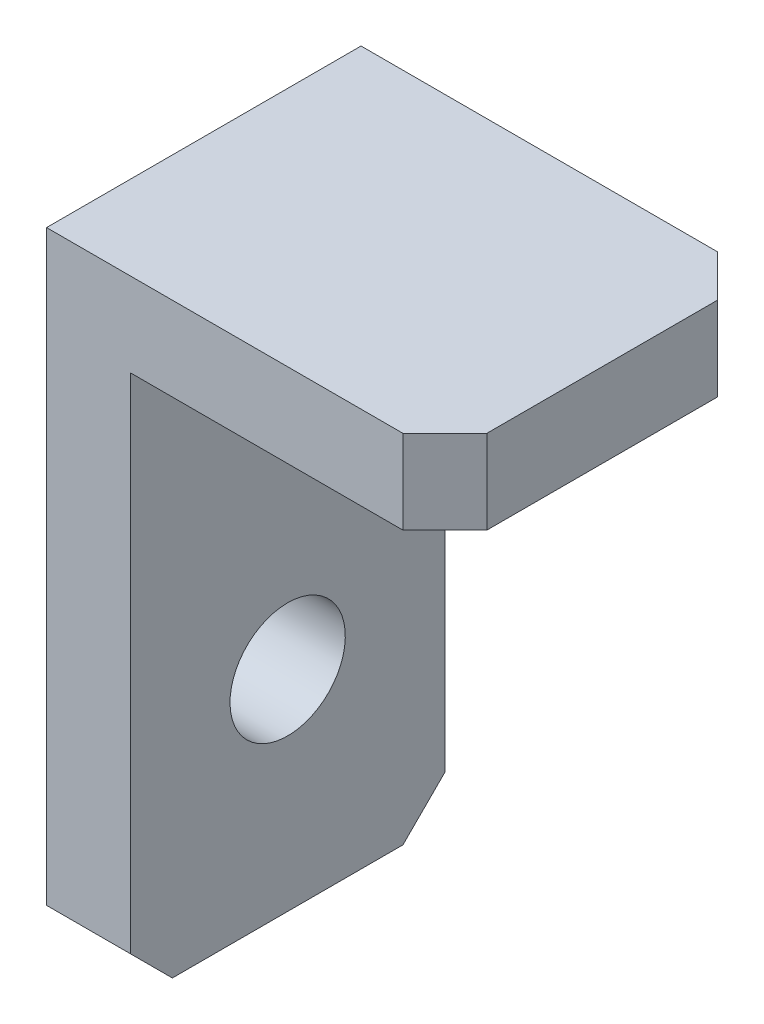
ISO-10303-21;
HEADER;
FILE_DESCRIPTION(('STEP AP214'),'2;1');
FILE_NAME('part.step','',(''),(''),'','','');
FILE_SCHEMA(('AUTOMOTIVE_DESIGN { 1 0 10303 214 1 1 1 1 }'));
ENDSEC;
DATA;
#1=APPLICATION_CONTEXT('core data for automotive mechanical design processes');
#2=APPLICATION_PROTOCOL_DEFINITION('international standard','automotive_design',2000,#1);
#3=PRODUCT_CONTEXT('',#1,'mechanical');
#4=PRODUCT('Part','Part','',(#3));
#5=PRODUCT_RELATED_PRODUCT_CATEGORY('part','',(#4));
#6=PRODUCT_DEFINITION_FORMATION('','',#4);
#7=PRODUCT_DEFINITION_CONTEXT('part definition',#1,'design');
#8=PRODUCT_DEFINITION('design','',#6,#7);
#9=PRODUCT_DEFINITION_SHAPE('','',#8);
#10=(LENGTH_UNIT() NAMED_UNIT(*) SI_UNIT(.MILLI.,.METRE.));
#11=(NAMED_UNIT(*) PLANE_ANGLE_UNIT() SI_UNIT($,.RADIAN.));
#12=(NAMED_UNIT(*) SI_UNIT($,.STERADIAN.) SOLID_ANGLE_UNIT());
#13=UNCERTAINTY_MEASURE_WITH_UNIT(LENGTH_MEASURE(1.E-05),#10,'distance_accuracy_value','');
#14=(GEOMETRIC_REPRESENTATION_CONTEXT(3) GLOBAL_UNCERTAINTY_ASSIGNED_CONTEXT((#13)) GLOBAL_UNIT_ASSIGNED_CONTEXT((#10,
#11,#12)) REPRESENTATION_CONTEXT('',''));
#15=CARTESIAN_POINT('',(0.,0.,0.));
#16=DIRECTION('',(0.,0.,1.));
#17=DIRECTION('',(1.,0.,0.));
#18=AXIS2_PLACEMENT_3D('',#15,#16,#17);
#19=CARTESIAN_POINT('',(0.,-30.,15.));
#20=DIRECTION('',(1.,0.,0.));
#21=DIRECTION('',(0.,0.,-1.));
#22=AXIS2_PLACEMENT_3D('',#19,#20,#21);
#23=PLANE('',#22);
#24=CARTESIAN_POINT('',(0.,-20.,7.5));
#25=DIRECTION('',(1.,0.,0.));
#26=DIRECTION('',(0.,0.,-1.));
#27=AXIS2_PLACEMENT_3D('',#24,#25,#26);
#28=CIRCLE('',#27,2.75);
#29=CARTESIAN_POINT('',(0.,-20.,4.75));
#30=VERTEX_POINT('',#29);
#31=EDGE_CURVE('E144',#30,#30,#28,.F.);
#32=ORIENTED_EDGE('',*,*,#31,.F.);
#33=EDGE_LOOP('',(#32));
#34=FACE_BOUND('',#33,.T.);
#35=DIRECTION('',(0.,0.,-1.));
#36=VECTOR('',#35,1.);
#37=CARTESIAN_POINT('',(0.,-30.,15.));
#38=LINE('',#37,#36);
#39=CARTESIAN_POINT('',(0.,-30.,13.));
#40=VERTEX_POINT('',#39);
#41=CARTESIAN_POINT('',(0.,-30.,2.00000000000001));
#42=VERTEX_POINT('',#41);
#43=EDGE_CURVE('E158',#40,#42,#38,.T.);
#44=ORIENTED_EDGE('',*,*,#43,.F.);
#45=DIRECTION('',(0.,-0.707106781186547,-0.707106781186548));
#46=VECTOR('',#45,1.);
#47=CARTESIAN_POINT('',(0.,-28.,15.));
#48=LINE('',#47,#46);
#49=CARTESIAN_POINT('',(0.,-28.,15.));
#50=VERTEX_POINT('',#49);
#51=EDGE_CURVE('E175',#40,#50,#48,.F.);
#52=ORIENTED_EDGE('',*,*,#51,.T.);
#53=DIRECTION('',(0.,-1.,0.));
#54=VECTOR('',#53,1.);
#55=CARTESIAN_POINT('',(0.,-30.,15.));
#56=LINE('',#55,#54);
#57=CARTESIAN_POINT('',(0.,0.,15.));
#58=VERTEX_POINT('',#57);
#59=EDGE_CURVE('E122',#58,#50,#56,.T.);
#60=ORIENTED_EDGE('',*,*,#59,.F.);
#61=DIRECTION('',(0.,0.,-1.));
#62=VECTOR('',#61,1.);
#63=CARTESIAN_POINT('',(0.,0.,15.));
#64=LINE('',#63,#62);
#65=CARTESIAN_POINT('',(0.,0.,0.));
#66=VERTEX_POINT('',#65);
#67=EDGE_CURVE('E137',#58,#66,#64,.T.);
#68=ORIENTED_EDGE('',*,*,#67,.T.);
#69=DIRECTION('',(0.,-1.,0.));
#70=VECTOR('',#69,1.);
#71=CARTESIAN_POINT('',(0.,-30.,0.));
#72=LINE('',#71,#70);
#73=CARTESIAN_POINT('',(0.,-28.,0.));
#74=VERTEX_POINT('',#73);
#75=EDGE_CURVE('E141',#66,#74,#72,.T.);
#76=ORIENTED_EDGE('',*,*,#75,.T.);
#77=DIRECTION('',(0.,-0.707106781186548,0.707106781186547));
#78=VECTOR('',#77,1.);
#79=CARTESIAN_POINT('',(0.,-30.,2.00000000000001));
#80=LINE('',#79,#78);
#81=EDGE_CURVE('E173',#74,#42,#80,.T.);
#82=ORIENTED_EDGE('',*,*,#81,.T.);
#83=EDGE_LOOP('',(#44,#52,#60,#68,#76,#82));
#84=FACE_BOUND('',#83,.T.);
#85=ADVANCED_FACE('F33',(#34,#84),#23,.F.);
#86=CARTESIAN_POINT('',(4.,-30.,15.));
#87=DIRECTION('',(0.,1.,0.));
#88=DIRECTION('',(0.,0.,1.));
#89=AXIS2_PLACEMENT_3D('',#86,#87,#88);
#90=PLANE('',#89);
#91=DIRECTION('',(0.,0.,-1.));
#92=VECTOR('',#91,1.);
#93=CARTESIAN_POINT('',(4.,-30.,15.));
#94=LINE('',#93,#92);
#95=CARTESIAN_POINT('',(4.,-30.,13.));
#96=VERTEX_POINT('',#95);
#97=CARTESIAN_POINT('',(4.,-30.,2.00000000000001));
#98=VERTEX_POINT('',#97);
#99=EDGE_CURVE('E130',#96,#98,#94,.T.);
#100=ORIENTED_EDGE('',*,*,#99,.F.);
#101=DIRECTION('',(-1.,0.,0.));
#102=VECTOR('',#101,1.);
#103=CARTESIAN_POINT('',(4.,-30.,13.));
#104=LINE('',#103,#102);
#105=EDGE_CURVE('E171',#96,#40,#104,.T.);
#106=ORIENTED_EDGE('',*,*,#105,.T.);
#107=ORIENTED_EDGE('',*,*,#43,.T.);
#108=DIRECTION('',(1.,0.,0.));
#109=VECTOR('',#108,1.);
#110=CARTESIAN_POINT('',(4.,-30.,2.00000000000001));
#111=LINE('',#110,#109);
#112=EDGE_CURVE('E168',#42,#98,#111,.T.);
#113=ORIENTED_EDGE('',*,*,#112,.T.);
#114=EDGE_LOOP('',(#100,#106,#107,#113));
#115=FACE_BOUND('',#114,.T.);
#116=ADVANCED_FACE('F217',(#115),#90,.F.);
#117=CARTESIAN_POINT('',(4.,-4.,15.));
#118=DIRECTION('',(-1.,0.,0.));
#119=DIRECTION('',(0.,-1.,0.));
#120=AXIS2_PLACEMENT_3D('',#117,#118,#119);
#121=PLANE('',#120);
#122=CARTESIAN_POINT('',(4.,-20.,7.5));
#123=DIRECTION('',(1.,0.,0.));
#124=DIRECTION('',(0.,1.,0.));
#125=AXIS2_PLACEMENT_3D('',#122,#123,#124);
#126=CIRCLE('',#125,2.75);
#127=CARTESIAN_POINT('',(4.,-17.25,7.5));
#128=VERTEX_POINT('',#127);
#129=EDGE_CURVE('E209',#128,#128,#126,.T.);
#130=ORIENTED_EDGE('',*,*,#129,.F.);
#131=EDGE_LOOP('',(#130));
#132=FACE_BOUND('',#131,.T.);
#133=DIRECTION('',(0.,1.,0.));
#134=VECTOR('',#133,1.);
#135=CARTESIAN_POINT('',(4.,-4.,15.));
#136=LINE('',#135,#134);
#137=CARTESIAN_POINT('',(4.,-28.,15.));
#138=VERTEX_POINT('',#137);
#139=CARTESIAN_POINT('',(4.,-4.,15.));
#140=VERTEX_POINT('',#139);
#141=EDGE_CURVE('E111',#138,#140,#136,.T.);
#142=ORIENTED_EDGE('',*,*,#141,.F.);
#143=DIRECTION('',(0.,0.707106781186547,0.707106781186548));
#144=VECTOR('',#143,1.);
#145=CARTESIAN_POINT('',(4.,-28.,15.));
#146=LINE('',#145,#144);
#147=EDGE_CURVE('E166',#138,#96,#146,.F.);
#148=ORIENTED_EDGE('',*,*,#147,.T.);
#149=ORIENTED_EDGE('',*,*,#99,.T.);
#150=DIRECTION('',(0.,0.707106781186548,-0.707106781186547));
#151=VECTOR('',#150,1.);
#152=CARTESIAN_POINT('',(4.,-30.,2.00000000000001));
#153=LINE('',#152,#151);
#154=CARTESIAN_POINT('',(4.,-28.,0.));
#155=VERTEX_POINT('',#154);
#156=EDGE_CURVE('E164',#98,#155,#153,.T.);
#157=ORIENTED_EDGE('',*,*,#156,.T.);
#158=DIRECTION('',(0.,1.,0.));
#159=VECTOR('',#158,1.);
#160=CARTESIAN_POINT('',(4.,-4.,0.));
#161=LINE('',#160,#159);
#162=CARTESIAN_POINT('',(4.,-4.,0.));
#163=VERTEX_POINT('',#162);
#164=EDGE_CURVE('E128',#155,#163,#161,.T.);
#165=ORIENTED_EDGE('',*,*,#164,.T.);
#166=DIRECTION('',(0.,0.,-1.));
#167=VECTOR('',#166,1.);
#168=CARTESIAN_POINT('',(4.,-4.,15.));
#169=LINE('',#168,#167);
#170=EDGE_CURVE('E125',#140,#163,#169,.T.);
#171=ORIENTED_EDGE('',*,*,#170,.F.);
#172=EDGE_LOOP('',(#142,#148,#149,#157,#165,#171));
#173=FACE_BOUND('',#172,.T.);
#174=ADVANCED_FACE('F126',(#132,#173),#121,.F.);
#175=CARTESIAN_POINT('',(19.,-4.,15.));
#176=DIRECTION('',(0.,1.,0.));
#177=DIRECTION('',(-1.,0.,0.));
#178=AXIS2_PLACEMENT_3D('',#175,#176,#177);
#179=PLANE('',#178);
#180=DIRECTION('',(1.,0.,0.));
#181=VECTOR('',#180,1.);
#182=CARTESIAN_POINT('',(19.,-4.,0.));
#183=LINE('',#182,#181);
#184=CARTESIAN_POINT('',(17.,-4.,0.));
#185=VERTEX_POINT('',#184);
#186=EDGE_CURVE('E146',#163,#185,#183,.T.);
#187=ORIENTED_EDGE('',*,*,#186,.T.);
#188=DIRECTION('',(0.707106781186548,0.,0.707106781186547));
#189=VECTOR('',#188,1.);
#190=CARTESIAN_POINT('',(19.,-4.,2.00000000000001));
#191=LINE('',#190,#189);
#192=CARTESIAN_POINT('',(19.,-4.,2.00000000000001));
#193=VERTEX_POINT('',#192);
#194=EDGE_CURVE('E11',#185,#193,#191,.T.);
#195=ORIENTED_EDGE('',*,*,#194,.T.);
#196=DIRECTION('',(0.,0.,-1.));
#197=VECTOR('',#196,1.);
#198=CARTESIAN_POINT('',(19.,-4.,15.));
#199=LINE('',#198,#197);
#200=CARTESIAN_POINT('',(19.,-4.,13.));
#201=VERTEX_POINT('',#200);
#202=EDGE_CURVE('E131',#201,#193,#199,.T.);
#203=ORIENTED_EDGE('',*,*,#202,.F.);
#204=DIRECTION('',(0.707106781186547,0.,-0.707106781186548));
#205=VECTOR('',#204,1.);
#206=CARTESIAN_POINT('',(17.,-4.,15.));
#207=LINE('',#206,#205);
#208=CARTESIAN_POINT('',(17.,-4.,15.));
#209=VERTEX_POINT('',#208);
#210=EDGE_CURVE('E41',#201,#209,#207,.F.);
#211=ORIENTED_EDGE('',*,*,#210,.T.);
#212=DIRECTION('',(1.,0.,0.));
#213=VECTOR('',#212,1.);
#214=CARTESIAN_POINT('',(19.,-4.,15.));
#215=LINE('',#214,#213);
#216=EDGE_CURVE('E117',#140,#209,#215,.T.);
#217=ORIENTED_EDGE('',*,*,#216,.F.);
#218=ORIENTED_EDGE('',*,*,#170,.T.);
#219=EDGE_LOOP('',(#187,#195,#203,#211,#217,#218));
#220=FACE_BOUND('',#219,.T.);
#221=ADVANCED_FACE('F133',(#220),#179,.F.);
#222=CARTESIAN_POINT('',(19.,0.,15.));
#223=DIRECTION('',(-1.,0.,0.));
#224=DIRECTION('',(0.,0.,1.));
#225=AXIS2_PLACEMENT_3D('',#222,#223,#224);
#226=PLANE('',#225);
#227=ORIENTED_EDGE('',*,*,#202,.T.);
#228=DIRECTION('',(0.,1.,0.));
#229=VECTOR('',#228,1.);
#230=CARTESIAN_POINT('',(19.,0.,2.00000000000001));
#231=LINE('',#230,#229);
#232=CARTESIAN_POINT('',(19.,0.,2.00000000000001));
#233=VERTEX_POINT('',#232);
#234=EDGE_CURVE('E182',#193,#233,#231,.T.);
#235=ORIENTED_EDGE('',*,*,#234,.T.);
#236=DIRECTION('',(0.,0.,-1.));
#237=VECTOR('',#236,1.);
#238=CARTESIAN_POINT('',(19.,0.,15.));
#239=LINE('',#238,#237);
#240=CARTESIAN_POINT('',(19.,0.,13.));
#241=VERTEX_POINT('',#240);
#242=EDGE_CURVE('E152',#241,#233,#239,.T.);
#243=ORIENTED_EDGE('',*,*,#242,.F.);
#244=DIRECTION('',(0.,-1.,0.));
#245=VECTOR('',#244,1.);
#246=CARTESIAN_POINT('',(19.,0.,13.));
#247=LINE('',#246,#245);
#248=EDGE_CURVE('E53',#241,#201,#247,.T.);
#249=ORIENTED_EDGE('',*,*,#248,.T.);
#250=EDGE_LOOP('',(#227,#235,#243,#249));
#251=FACE_BOUND('',#250,.T.);
#252=ADVANCED_FACE('F199',(#251),#226,.F.);
#253=CARTESIAN_POINT('',(0.,0.,15.));
#254=DIRECTION('',(0.,-1.,0.));
#255=DIRECTION('',(0.,0.,-1.));
#256=AXIS2_PLACEMENT_3D('',#253,#254,#255);
#257=PLANE('',#256);
#258=ORIENTED_EDGE('',*,*,#242,.T.);
#259=DIRECTION('',(-0.707106781186548,0.,-0.707106781186547));
#260=VECTOR('',#259,1.);
#261=CARTESIAN_POINT('',(19.,0.,2.00000000000001));
#262=LINE('',#261,#260);
#263=CARTESIAN_POINT('',(17.,0.,0.));
#264=VERTEX_POINT('',#263);
#265=EDGE_CURVE('E187',#233,#264,#262,.T.);
#266=ORIENTED_EDGE('',*,*,#265,.T.);
#267=DIRECTION('',(-1.,0.,0.));
#268=VECTOR('',#267,1.);
#269=CARTESIAN_POINT('',(0.,0.,0.));
#270=LINE('',#269,#268);
#271=EDGE_CURVE('E148',#264,#66,#270,.T.);
#272=ORIENTED_EDGE('',*,*,#271,.T.);
#273=ORIENTED_EDGE('',*,*,#67,.F.);
#274=DIRECTION('',(-1.,0.,0.));
#275=VECTOR('',#274,1.);
#276=CARTESIAN_POINT('',(0.,0.,15.));
#277=LINE('',#276,#275);
#278=CARTESIAN_POINT('',(17.,0.,15.));
#279=VERTEX_POINT('',#278);
#280=EDGE_CURVE('E135',#279,#58,#277,.T.);
#281=ORIENTED_EDGE('',*,*,#280,.F.);
#282=DIRECTION('',(-0.707106781186547,0.,0.707106781186548));
#283=VECTOR('',#282,1.);
#284=CARTESIAN_POINT('',(17.,0.,15.));
#285=LINE('',#284,#283);
#286=EDGE_CURVE('E185',#279,#241,#285,.F.);
#287=ORIENTED_EDGE('',*,*,#286,.T.);
#288=EDGE_LOOP('',(#258,#266,#272,#273,#281,#287));
#289=FACE_BOUND('',#288,.T.);
#290=ADVANCED_FACE('F190',(#289),#257,.F.);
#291=CARTESIAN_POINT('',(0.,0.,15.));
#292=DIRECTION('',(0.,0.,-1.));
#293=DIRECTION('',(-1.,0.,0.));
#294=AXIS2_PLACEMENT_3D('',#291,#292,#293);
#295=PLANE('',#294);
#296=ORIENTED_EDGE('',*,*,#59,.T.);
#297=DIRECTION('',(1.,0.,0.));
#298=VECTOR('',#297,1.);
#299=CARTESIAN_POINT('',(0.,-28.,15.));
#300=LINE('',#299,#298);
#301=EDGE_CURVE('E120',#50,#138,#300,.T.);
#302=ORIENTED_EDGE('',*,*,#301,.T.);
#303=ORIENTED_EDGE('',*,*,#141,.T.);
#304=ORIENTED_EDGE('',*,*,#216,.T.);
#305=DIRECTION('',(0.,1.,0.));
#306=VECTOR('',#305,1.);
#307=CARTESIAN_POINT('',(17.,0.,15.));
#308=LINE('',#307,#306);
#309=EDGE_CURVE('E161',#209,#279,#308,.T.);
#310=ORIENTED_EDGE('',*,*,#309,.T.);
#311=ORIENTED_EDGE('',*,*,#280,.T.);
#312=EDGE_LOOP('',(#296,#302,#303,#304,#310,#311));
#313=FACE_BOUND('',#312,.T.);
#314=ADVANCED_FACE('F114',(#313),#295,.F.);
#315=CARTESIAN_POINT('',(0.,0.,0.));
#316=DIRECTION('',(0.,0.,-1.));
#317=DIRECTION('',(-1.,0.,0.));
#318=AXIS2_PLACEMENT_3D('',#315,#316,#317);
#319=PLANE('',#318);
#320=ORIENTED_EDGE('',*,*,#164,.F.);
#321=DIRECTION('',(-1.,0.,0.));
#322=VECTOR('',#321,1.);
#323=CARTESIAN_POINT('',(0.,-28.,0.));
#324=LINE('',#323,#322);
#325=EDGE_CURVE('E179',#155,#74,#324,.T.);
#326=ORIENTED_EDGE('',*,*,#325,.T.);
#327=ORIENTED_EDGE('',*,*,#75,.F.);
#328=ORIENTED_EDGE('',*,*,#271,.F.);
#329=DIRECTION('',(0.,-1.,0.));
#330=VECTOR('',#329,1.);
#331=CARTESIAN_POINT('',(17.,-4.,0.));
#332=LINE('',#331,#330);
#333=EDGE_CURVE('E177',#264,#185,#332,.T.);
#334=ORIENTED_EDGE('',*,*,#333,.T.);
#335=ORIENTED_EDGE('',*,*,#186,.F.);
#336=EDGE_LOOP('',(#320,#326,#327,#328,#334,#335));
#337=FACE_BOUND('',#336,.T.);
#338=ADVANCED_FACE('F197',(#337),#319,.T.);
#339=CARTESIAN_POINT('',(-0.00100000000000187,-20.,7.5));
#340=DIRECTION('',(1.,0.,0.));
#341=DIRECTION('',(0.,1.,0.));
#342=AXIS2_PLACEMENT_3D('',#339,#340,#341);
#343=CYLINDRICAL_SURFACE('',#342,2.75);
#344=ORIENTED_EDGE('',*,*,#129,.T.);
#345=EDGE_LOOP('',(#344));
#346=FACE_BOUND('',#345,.T.);
#347=ORIENTED_EDGE('',*,*,#31,.T.);
#348=EDGE_LOOP('',(#347));
#349=FACE_BOUND('',#348,.T.);
#350=ADVANCED_FACE('F213',(#346,#349),#343,.F.);
#351=CARTESIAN_POINT('',(0.,-28.,15.));
#352=DIRECTION('',(0.,0.707106781186548,-0.707106781186547));
#353=DIRECTION('',(1.,0.,0.));
#354=AXIS2_PLACEMENT_3D('',#351,#352,#353);
#355=PLANE('',#354);
#356=ORIENTED_EDGE('',*,*,#51,.F.);
#357=ORIENTED_EDGE('',*,*,#105,.F.);
#358=ORIENTED_EDGE('',*,*,#147,.F.);
#359=ORIENTED_EDGE('',*,*,#301,.F.);
#360=EDGE_LOOP('',(#356,#357,#358,#359));
#361=FACE_BOUND('',#360,.T.);
#362=ADVANCED_FACE('F233',(#361),#355,.F.);
#363=CARTESIAN_POINT('',(4.,-30.,2.00000000000001));
#364=DIRECTION('',(0.,-0.707106781186547,-0.707106781186548));
#365=DIRECTION('',(-1.,0.,0.));
#366=AXIS2_PLACEMENT_3D('',#363,#364,#365);
#367=PLANE('',#366);
#368=ORIENTED_EDGE('',*,*,#81,.F.);
#369=ORIENTED_EDGE('',*,*,#325,.F.);
#370=ORIENTED_EDGE('',*,*,#156,.F.);
#371=ORIENTED_EDGE('',*,*,#112,.F.);
#372=EDGE_LOOP('',(#368,#369,#370,#371));
#373=FACE_BOUND('',#372,.T.);
#374=ADVANCED_FACE('F236',(#373),#367,.T.);
#375=CARTESIAN_POINT('',(19.,0.,2.00000000000001));
#376=DIRECTION('',(0.707106781186547,0.,-0.707106781186548));
#377=DIRECTION('',(0.,-1.,0.));
#378=AXIS2_PLACEMENT_3D('',#375,#376,#377);
#379=PLANE('',#378);
#380=ORIENTED_EDGE('',*,*,#194,.F.);
#381=ORIENTED_EDGE('',*,*,#333,.F.);
#382=ORIENTED_EDGE('',*,*,#265,.F.);
#383=ORIENTED_EDGE('',*,*,#234,.F.);
#384=EDGE_LOOP('',(#380,#381,#382,#383));
#385=FACE_BOUND('',#384,.T.);
#386=ADVANCED_FACE('F198',(#385),#379,.T.);
#387=CARTESIAN_POINT('',(17.,0.,15.));
#388=DIRECTION('',(-0.707106781186548,0.,-0.707106781186547));
#389=DIRECTION('',(0.,1.,0.));
#390=AXIS2_PLACEMENT_3D('',#387,#388,#389);
#391=PLANE('',#390);
#392=ORIENTED_EDGE('',*,*,#210,.F.);
#393=ORIENTED_EDGE('',*,*,#248,.F.);
#394=ORIENTED_EDGE('',*,*,#286,.F.);
#395=ORIENTED_EDGE('',*,*,#309,.F.);
#396=EDGE_LOOP('',(#392,#393,#394,#395));
#397=FACE_BOUND('',#396,.T.);
#398=ADVANCED_FACE('F35',(#397),#391,.F.);
#399=CLOSED_SHELL('',(#85,#116,#174,#221,#252,#290,#314,#338,#350,#362,#374,#386,#398));
#400=MANIFOLD_SOLID_BREP('B2',#399);
#401=ADVANCED_BREP_SHAPE_REPRESENTATION('',(#18,#400),#14);
#402=SHAPE_DEFINITION_REPRESENTATION(#9,#401);
ENDSEC;
END-ISO-10303-21;
